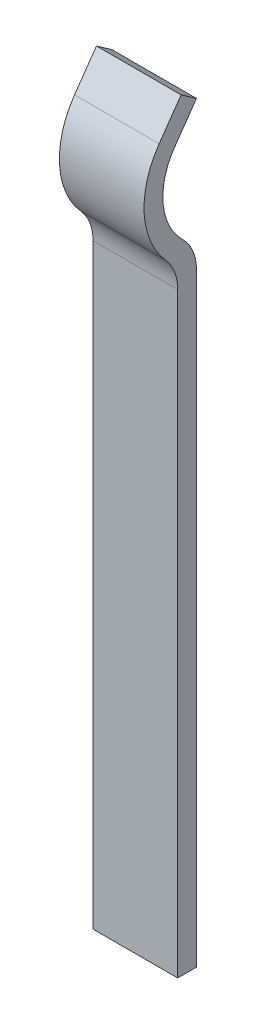
ISO-10303-21;
HEADER;
FILE_DESCRIPTION(('STEP AP214'),'2;1');
FILE_NAME('part.step','',(''),(''),'','','');
FILE_SCHEMA(('AUTOMOTIVE_DESIGN { 1 0 10303 214 1 1 1 1 }'));
ENDSEC;
DATA;
#1=APPLICATION_CONTEXT('core data for automotive mechanical design processes');
#2=APPLICATION_PROTOCOL_DEFINITION('international standard','automotive_design',2000,#1);
#3=PRODUCT_CONTEXT('',#1,'mechanical');
#4=PRODUCT('Part','Part','',(#3));
#5=PRODUCT_RELATED_PRODUCT_CATEGORY('part','',(#4));
#6=PRODUCT_DEFINITION_FORMATION('','',#4);
#7=PRODUCT_DEFINITION_CONTEXT('part definition',#1,'design');
#8=PRODUCT_DEFINITION('design','',#6,#7);
#9=PRODUCT_DEFINITION_SHAPE('','',#8);
#10=(LENGTH_UNIT() NAMED_UNIT(*) SI_UNIT(.MILLI.,.METRE.));
#11=(NAMED_UNIT(*) PLANE_ANGLE_UNIT() SI_UNIT($,.RADIAN.));
#12=(NAMED_UNIT(*) SI_UNIT($,.STERADIAN.) SOLID_ANGLE_UNIT());
#13=UNCERTAINTY_MEASURE_WITH_UNIT(LENGTH_MEASURE(1.E-05),#10,'distance_accuracy_value','');
#14=(GEOMETRIC_REPRESENTATION_CONTEXT(3) GLOBAL_UNCERTAINTY_ASSIGNED_CONTEXT((#13)) GLOBAL_UNIT_ASSIGNED_CONTEXT((#10,
#11,#12)) REPRESENTATION_CONTEXT('',''));
#15=CARTESIAN_POINT('',(0.,0.,0.));
#16=DIRECTION('',(0.,0.,1.));
#17=DIRECTION('',(1.,0.,0.));
#18=AXIS2_PLACEMENT_3D('',#15,#16,#17);
#19=CARTESIAN_POINT('',(0.,5.5,0.));
#20=DIRECTION('',(0.,0.819152044288992,-0.573576436351046));
#21=DIRECTION('',(0.,0.573576436351046,0.819152044288992));
#22=AXIS2_PLACEMENT_3D('',#19,#20,#21);
#23=PLANE('',#22);
#24=DIRECTION('',(0.,0.573576436351046,0.819152044288992));
#25=VECTOR('',#24,1.);
#26=CARTESIAN_POINT('',(1.35,5.5,0.));
#27=LINE('',#26,#25);
#28=CARTESIAN_POINT('',(1.35,5.67207293090531,0.245745613286696));
#29=VERTEX_POINT('',#28);
#30=CARTESIAN_POINT('',(1.35,5.5,0.));
#31=VERTEX_POINT('',#30);
#32=EDGE_CURVE('E155',#29,#31,#27,.F.);
#33=ORIENTED_EDGE('',*,*,#32,.T.);
#34=DIRECTION('',(1.,0.,0.));
#35=VECTOR('',#34,1.);
#36=CARTESIAN_POINT('',(0.,5.5,0.));
#37=LINE('',#36,#35);
#38=CARTESIAN_POINT('',(0.,5.5,0.));
#39=VERTEX_POINT('',#38);
#40=EDGE_CURVE('E149',#39,#31,#37,.T.);
#41=ORIENTED_EDGE('',*,*,#40,.F.);
#42=DIRECTION('',(0.,0.573576436351046,0.819152044288992));
#43=VECTOR('',#42,1.);
#44=CARTESIAN_POINT('',(0.,5.5,0.));
#45=LINE('',#44,#43);
#46=CARTESIAN_POINT('',(0.,5.67207293090531,0.245745613286696));
#47=VERTEX_POINT('',#46);
#48=EDGE_CURVE('E163',#39,#47,#45,.T.);
#49=ORIENTED_EDGE('',*,*,#48,.T.);
#50=DIRECTION('',(1.,0.,0.));
#51=VECTOR('',#50,1.);
#52=CARTESIAN_POINT('',(0.,5.67207293090532,0.245745613286696));
#53=LINE('',#52,#51);
#54=EDGE_CURVE('E102',#29,#47,#53,.F.);
#55=ORIENTED_EDGE('',*,*,#54,.F.);
#56=EDGE_LOOP('',(#33,#41,#49,#55));
#57=FACE_BOUND('',#56,.T.);
#58=ADVANCED_FACE('F16',(#57),#23,.T.);
#59=CARTESIAN_POINT('',(0.,5.,0.350103769104855));
#60=DIRECTION('',(0.,-0.573576436351046,-0.819152044288992));
#61=DIRECTION('',(0.,0.819152044288992,-0.573576436351046));
#62=AXIS2_PLACEMENT_3D('',#59,#60,#61);
#63=PLANE('',#62);
#64=DIRECTION('',(0.,0.819152044288992,-0.573576436351046));
#65=VECTOR('',#64,1.);
#66=CARTESIAN_POINT('',(1.35,5.,0.350103769104855));
#67=LINE('',#66,#65);
#68=CARTESIAN_POINT('',(1.35,5.,0.350103769104855));
#69=VERTEX_POINT('',#68);
#70=EDGE_CURVE('E145',#31,#69,#67,.F.);
#71=ORIENTED_EDGE('',*,*,#70,.T.);
#72=DIRECTION('',(1.,0.,0.));
#73=VECTOR('',#72,1.);
#74=CARTESIAN_POINT('',(0.,5.,0.350103769104856));
#75=LINE('',#74,#73);
#76=CARTESIAN_POINT('',(0.,5.,0.350103769104855));
#77=VERTEX_POINT('',#76);
#78=EDGE_CURVE('E135',#69,#77,#75,.F.);
#79=ORIENTED_EDGE('',*,*,#78,.T.);
#80=DIRECTION('',(0.,0.819152044288992,-0.573576436351046));
#81=VECTOR('',#80,1.);
#82=CARTESIAN_POINT('',(0.,5.,0.350103769104855));
#83=LINE('',#82,#81);
#84=EDGE_CURVE('E152',#77,#39,#83,.T.);
#85=ORIENTED_EDGE('',*,*,#84,.T.);
#86=ORIENTED_EDGE('',*,*,#40,.T.);
#87=EDGE_LOOP('',(#71,#79,#85,#86));
#88=FACE_BOUND('',#87,.T.);
#89=ADVANCED_FACE('F200',(#88),#63,.T.);
#90=CARTESIAN_POINT('',(0.,5.67207293090531,0.245745613286697));
#91=DIRECTION('',(0.,0.573576436351046,0.819152044288992));
#92=DIRECTION('',(0.,-0.819152044288992,0.573576436351046));
#93=AXIS2_PLACEMENT_3D('',#90,#91,#92);
#94=PLANE('',#93);
#95=DIRECTION('',(0.,-0.819152044288992,0.573576436351046));
#96=VECTOR('',#95,1.);
#97=CARTESIAN_POINT('',(1.35,5.67207293090531,0.245745613286697));
#98=LINE('',#97,#96);
#99=CARTESIAN_POINT('',(1.35,5.17207293090531,0.595849382391553));
#100=VERTEX_POINT('',#99);
#101=EDGE_CURVE('E138',#100,#29,#98,.F.);
#102=ORIENTED_EDGE('',*,*,#101,.T.);
#103=ORIENTED_EDGE('',*,*,#54,.T.);
#104=DIRECTION('',(0.,-0.819152044288992,0.573576436351046));
#105=VECTOR('',#104,1.);
#106=CARTESIAN_POINT('',(0.,5.67207293090531,0.245745613286697));
#107=LINE('',#106,#105);
#108=CARTESIAN_POINT('',(0.,5.17207293090531,0.595849382391553));
#109=VERTEX_POINT('',#108);
#110=EDGE_CURVE('E141',#47,#109,#107,.T.);
#111=ORIENTED_EDGE('',*,*,#110,.T.);
#112=DIRECTION('',(1.,0.,0.));
#113=VECTOR('',#112,1.);
#114=CARTESIAN_POINT('',(0.,5.17207293090531,0.595849382391554));
#115=LINE('',#114,#113);
#116=EDGE_CURVE('E109',#100,#109,#115,.F.);
#117=ORIENTED_EDGE('',*,*,#116,.F.);
#118=EDGE_LOOP('',(#102,#103,#111,#117));
#119=FACE_BOUND('',#118,.T.);
#120=ADVANCED_FACE('F194',(#119),#94,.T.);
#121=CARTESIAN_POINT('',(0.,3.01030980567423,1.05));
#122=DIRECTION('',(1.,0.,0.));
#123=DIRECTION('',(0.,0.,-1.));
#124=AXIS2_PLACEMENT_3D('',#121,#122,#123);
#125=CYLINDRICAL_SURFACE('',#124,0.75);
#126=DIRECTION('',(1.,0.,0.));
#127=VECTOR('',#126,1.);
#128=CARTESIAN_POINT('',(0.,3.01030980567423,0.300000000000001));
#129=LINE('',#128,#127);
#130=CARTESIAN_POINT('',(1.35,3.01030980567423,0.300000000000001));
#131=VERTEX_POINT('',#130);
#132=CARTESIAN_POINT('',(0.,3.01030980567423,0.300000000000001));
#133=VERTEX_POINT('',#132);
#134=EDGE_CURVE('E104',#131,#133,#129,.F.);
#135=ORIENTED_EDGE('',*,*,#134,.F.);
#136=CARTESIAN_POINT('',(1.35,3.01030980567423,1.05));
#137=DIRECTION('',(1.,0.,0.));
#138=DIRECTION('',(0.,0.,-1.));
#139=AXIS2_PLACEMENT_3D('',#136,#137,#138);
#140=CIRCLE('',#139,0.75);
#141=CARTESIAN_POINT('',(1.35,3.51287852426735,0.493291204406044));
#142=VERTEX_POINT('',#141);
#143=EDGE_CURVE('E19',#142,#131,#140,.F.);
#144=ORIENTED_EDGE('',*,*,#143,.F.);
#145=DIRECTION('',(1.,0.,0.));
#146=VECTOR('',#145,1.);
#147=CARTESIAN_POINT('',(0.,3.51287852426735,0.493291204406045));
#148=LINE('',#147,#146);
#149=CARTESIAN_POINT('',(0.,3.51287852426735,0.493291204406044));
#150=VERTEX_POINT('',#149);
#151=EDGE_CURVE('E133',#150,#142,#148,.T.);
#152=ORIENTED_EDGE('',*,*,#151,.F.);
#153=CARTESIAN_POINT('',(0.,3.01030980567423,1.05));
#154=DIRECTION('',(1.,0.,0.));
#155=DIRECTION('',(0.,0.,-1.));
#156=AXIS2_PLACEMENT_3D('',#153,#154,#155);
#157=CIRCLE('',#156,0.75);
#158=EDGE_CURVE('E101',#133,#150,#157,.T.);
#159=ORIENTED_EDGE('',*,*,#158,.F.);
#160=EDGE_LOOP('',(#135,#144,#152,#159));
#161=FACE_BOUND('',#160,.T.);
#162=ADVANCED_FACE('F105',(#161),#125,.F.);
#163=CARTESIAN_POINT('',(0.,4.40685683771464,-0.496992455825691));
#164=DIRECTION('',(1.,0.,0.));
#165=DIRECTION('',(0.,0.,-1.));
#166=AXIS2_PLACEMENT_3D('',#163,#164,#165);
#167=CYLINDRICAL_SURFACE('',#166,1.03411354563097);
#168=CARTESIAN_POINT('',(0.,4.40685683771464,-0.496992455825691));
#169=DIRECTION('',(1.,0.,0.));
#170=DIRECTION('',(0.,0.,-1.));
#171=AXIS2_PLACEMENT_3D('',#168,#169,#170);
#172=CIRCLE('',#171,1.03411354563097);
#173=CARTESIAN_POINT('',(0.,3.66728153304479,0.225793262060286));
#174=VERTEX_POINT('',#173);
#175=EDGE_CURVE('E128',#174,#77,#172,.F.);
#176=ORIENTED_EDGE('',*,*,#175,.T.);
#177=ORIENTED_EDGE('',*,*,#78,.F.);
#178=CARTESIAN_POINT('',(1.35,4.40685683771464,-0.496992455825691));
#179=DIRECTION('',(1.,0.,0.));
#180=DIRECTION('',(0.,0.,-1.));
#181=AXIS2_PLACEMENT_3D('',#178,#179,#180);
#182=CIRCLE('',#181,1.03411354563097);
#183=CARTESIAN_POINT('',(1.35,3.66728153304479,0.225793262060286));
#184=VERTEX_POINT('',#183);
#185=EDGE_CURVE('E117',#184,#69,#182,.F.);
#186=ORIENTED_EDGE('',*,*,#185,.F.);
#187=DIRECTION('',(1.,0.,0.));
#188=VECTOR('',#187,1.);
#189=CARTESIAN_POINT('',(0.,3.66728153304479,0.225793262060286));
#190=LINE('',#189,#188);
#191=EDGE_CURVE('E108',#174,#184,#190,.T.);
#192=ORIENTED_EDGE('',*,*,#191,.F.);
#193=EDGE_LOOP('',(#176,#177,#186,#192));
#194=FACE_BOUND('',#193,.T.);
#195=ADVANCED_FACE('F205',(#194),#167,.F.);
#196=CARTESIAN_POINT('',(0.,4.40685683771464,-0.496992455825691));
#197=DIRECTION('',(1.,0.,0.));
#198=DIRECTION('',(0.,0.,-1.));
#199=AXIS2_PLACEMENT_3D('',#196,#197,#198);
#200=CYLINDRICAL_SURFACE('',#199,1.33411354563097);
#201=ORIENTED_EDGE('',*,*,#116,.T.);
#202=CARTESIAN_POINT('',(0.,4.40685683771464,-0.496992455825691));
#203=DIRECTION('',(1.,0.,0.));
#204=DIRECTION('',(0.,0.,-1.));
#205=AXIS2_PLACEMENT_3D('',#202,#203,#204);
#206=CIRCLE('',#205,1.33411354563097);
#207=EDGE_CURVE('E178',#109,#150,#206,.T.);
#208=ORIENTED_EDGE('',*,*,#207,.T.);
#209=ORIENTED_EDGE('',*,*,#151,.T.);
#210=CARTESIAN_POINT('',(1.35,4.40685683771464,-0.496992455825691));
#211=DIRECTION('',(1.,0.,0.));
#212=DIRECTION('',(0.,0.,-1.));
#213=AXIS2_PLACEMENT_3D('',#210,#211,#212);
#214=CIRCLE('',#213,1.33411354563097);
#215=EDGE_CURVE('E100',#100,#142,#214,.T.);
#216=ORIENTED_EDGE('',*,*,#215,.F.);
#217=EDGE_LOOP('',(#201,#208,#209,#216));
#218=FACE_BOUND('',#217,.T.);
#219=ADVANCED_FACE('F191',(#218),#200,.T.);
#220=CARTESIAN_POINT('',(0.,3.33696806873304,0.300000000000001));
#221=DIRECTION('',(0.,0.,1.));
#222=DIRECTION('',(1.,0.,0.));
#223=AXIS2_PLACEMENT_3D('',#220,#221,#222);
#224=PLANE('',#223);
#225=DIRECTION('',(1.,0.,0.));
#226=VECTOR('',#225,1.);
#227=CARTESIAN_POINT('',(0.,-6.5,0.299999999999999));
#228=LINE('',#227,#226);
#229=CARTESIAN_POINT('',(1.35,-6.5,0.3));
#230=VERTEX_POINT('',#229);
#231=CARTESIAN_POINT('',(0.,-6.5,0.3));
#232=VERTEX_POINT('',#231);
#233=EDGE_CURVE('E112',#230,#232,#228,.F.);
#234=ORIENTED_EDGE('',*,*,#233,.F.);
#235=DIRECTION('',(0.,1.,0.));
#236=VECTOR('',#235,1.);
#237=CARTESIAN_POINT('',(1.35,-0.503811349581282,0.300000000000001));
#238=LINE('',#237,#236);
#239=EDGE_CURVE('E97',#131,#230,#238,.F.);
#240=ORIENTED_EDGE('',*,*,#239,.F.);
#241=ORIENTED_EDGE('',*,*,#134,.T.);
#242=DIRECTION('',(0.,1.,0.));
#243=VECTOR('',#242,1.);
#244=CARTESIAN_POINT('',(0.,-0.503811349581282,0.300000000000001));
#245=LINE('',#244,#243);
#246=EDGE_CURVE('E181',#133,#232,#245,.F.);
#247=ORIENTED_EDGE('',*,*,#246,.T.);
#248=EDGE_LOOP('',(#234,#240,#241,#247));
#249=FACE_BOUND('',#248,.T.);
#250=ADVANCED_FACE('F111',(#249),#224,.T.);
#251=CARTESIAN_POINT('',(0.,3.13089799871641,0.75));
#252=DIRECTION('',(1.,0.,0.));
#253=DIRECTION('',(0.,0.,-1.));
#254=AXIS2_PLACEMENT_3D('',#251,#252,#253);
#255=CYLINDRICAL_SURFACE('',#254,0.75);
#256=CARTESIAN_POINT('',(0.,3.13089799871641,0.75));
#257=DIRECTION('',(1.,0.,0.));
#258=DIRECTION('',(0.,0.,-1.));
#259=AXIS2_PLACEMENT_3D('',#256,#257,#258);
#260=CIRCLE('',#259,0.75);
#261=CARTESIAN_POINT('',(0.,3.13089799871641,0.));
#262=VERTEX_POINT('',#261);
#263=EDGE_CURVE('E174',#262,#174,#260,.T.);
#264=ORIENTED_EDGE('',*,*,#263,.T.);
#265=ORIENTED_EDGE('',*,*,#191,.T.);
#266=CARTESIAN_POINT('',(1.35,3.13089799871641,0.75));
#267=DIRECTION('',(1.,0.,0.));
#268=DIRECTION('',(0.,0.,-1.));
#269=AXIS2_PLACEMENT_3D('',#266,#267,#268);
#270=CIRCLE('',#269,0.75);
#271=CARTESIAN_POINT('',(1.35,3.13089799871641,0.));
#272=VERTEX_POINT('',#271);
#273=EDGE_CURVE('E126',#272,#184,#270,.T.);
#274=ORIENTED_EDGE('',*,*,#273,.F.);
#275=DIRECTION('',(-1.,0.,0.));
#276=VECTOR('',#275,1.);
#277=CARTESIAN_POINT('',(0.,3.13089799871641,0.));
#278=LINE('',#277,#276);
#279=EDGE_CURVE('E177',#262,#272,#278,.F.);
#280=ORIENTED_EDGE('',*,*,#279,.F.);
#281=EDGE_LOOP('',(#264,#265,#274,#280));
#282=FACE_BOUND('',#281,.T.);
#283=ADVANCED_FACE('F208',(#282),#255,.T.);
#284=CARTESIAN_POINT('',(1.35,-0.503811349581282,0.203319222379208));
#285=DIRECTION('',(1.,0.,0.));
#286=DIRECTION('',(0.,0.,-1.));
#287=AXIS2_PLACEMENT_3D('',#284,#285,#286);
#288=PLANE('',#287);
#289=DIRECTION('',(0.,0.,-1.));
#290=VECTOR('',#289,1.);
#291=CARTESIAN_POINT('',(1.35,-6.5,0.299999999999999));
#292=LINE('',#291,#290);
#293=CARTESIAN_POINT('',(1.35,-6.5,0.));
#294=VERTEX_POINT('',#293);
#295=EDGE_CURVE('E114',#294,#230,#292,.F.);
#296=ORIENTED_EDGE('',*,*,#295,.F.);
#297=DIRECTION('',(0.,1.,0.));
#298=VECTOR('',#297,1.);
#299=CARTESIAN_POINT('',(1.35,-6.5,0.));
#300=LINE('',#299,#298);
#301=EDGE_CURVE('E213',#272,#294,#300,.F.);
#302=ORIENTED_EDGE('',*,*,#301,.F.);
#303=ORIENTED_EDGE('',*,*,#273,.T.);
#304=ORIENTED_EDGE('',*,*,#185,.T.);
#305=ORIENTED_EDGE('',*,*,#70,.F.);
#306=ORIENTED_EDGE('',*,*,#32,.F.);
#307=ORIENTED_EDGE('',*,*,#101,.F.);
#308=ORIENTED_EDGE('',*,*,#215,.T.);
#309=ORIENTED_EDGE('',*,*,#143,.T.);
#310=ORIENTED_EDGE('',*,*,#239,.T.);
#311=EDGE_LOOP('',(#296,#302,#303,#304,#305,#306,#307,#308,#309,#310));
#312=FACE_BOUND('',#311,.T.);
#313=ADVANCED_FACE('F95',(#312),#288,.T.);
#314=CARTESIAN_POINT('',(0.,-6.5,0.299999999999999));
#315=DIRECTION('',(0.,-1.,0.));
#316=DIRECTION('',(0.,0.,-1.));
#317=AXIS2_PLACEMENT_3D('',#314,#315,#316);
#318=PLANE('',#317);
#319=ORIENTED_EDGE('',*,*,#295,.T.);
#320=ORIENTED_EDGE('',*,*,#233,.T.);
#321=DIRECTION('',(0.,0.,-1.));
#322=VECTOR('',#321,1.);
#323=CARTESIAN_POINT('',(0.,-6.5,0.203319222379208));
#324=LINE('',#323,#322);
#325=CARTESIAN_POINT('',(0.,-6.5,0.));
#326=VERTEX_POINT('',#325);
#327=EDGE_CURVE('E34',#232,#326,#324,.T.);
#328=ORIENTED_EDGE('',*,*,#327,.T.);
#329=DIRECTION('',(-1.,0.,0.));
#330=VECTOR('',#329,1.);
#331=CARTESIAN_POINT('',(0.,-6.5,0.));
#332=LINE('',#331,#330);
#333=EDGE_CURVE('E25',#294,#326,#332,.T.);
#334=ORIENTED_EDGE('',*,*,#333,.F.);
#335=EDGE_LOOP('',(#319,#320,#328,#334));
#336=FACE_BOUND('',#335,.T.);
#337=ADVANCED_FACE('F230',(#336),#318,.T.);
#338=CARTESIAN_POINT('',(0.,-0.503811349581282,0.203319222379208));
#339=DIRECTION('',(1.,0.,0.));
#340=DIRECTION('',(0.,0.,-1.));
#341=AXIS2_PLACEMENT_3D('',#338,#339,#340);
#342=PLANE('',#341);
#343=DIRECTION('',(0.,1.,0.));
#344=VECTOR('',#343,1.);
#345=CARTESIAN_POINT('',(0.,-6.5,0.));
#346=LINE('',#345,#344);
#347=EDGE_CURVE('E11',#326,#262,#346,.T.);
#348=ORIENTED_EDGE('',*,*,#347,.F.);
#349=ORIENTED_EDGE('',*,*,#327,.F.);
#350=ORIENTED_EDGE('',*,*,#246,.F.);
#351=ORIENTED_EDGE('',*,*,#158,.T.);
#352=ORIENTED_EDGE('',*,*,#207,.F.);
#353=ORIENTED_EDGE('',*,*,#110,.F.);
#354=ORIENTED_EDGE('',*,*,#48,.F.);
#355=ORIENTED_EDGE('',*,*,#84,.F.);
#356=ORIENTED_EDGE('',*,*,#175,.F.);
#357=ORIENTED_EDGE('',*,*,#263,.F.);
#358=EDGE_LOOP('',(#348,#349,#350,#351,#352,#353,#354,#355,#356,#357));
#359=FACE_BOUND('',#358,.T.);
#360=ADVANCED_FACE('F189',(#359),#342,.F.);
#361=CARTESIAN_POINT('',(0.,-6.5,0.));
#362=DIRECTION('',(0.,0.,-1.));
#363=DIRECTION('',(-1.,0.,0.));
#364=AXIS2_PLACEMENT_3D('',#361,#362,#363);
#365=PLANE('',#364);
#366=ORIENTED_EDGE('',*,*,#333,.T.);
#367=ORIENTED_EDGE('',*,*,#347,.T.);
#368=ORIENTED_EDGE('',*,*,#279,.T.);
#369=ORIENTED_EDGE('',*,*,#301,.T.);
#370=EDGE_LOOP('',(#366,#367,#368,#369));
#371=FACE_BOUND('',#370,.T.);
#372=ADVANCED_FACE('F229',(#371),#365,.T.);
#373=CLOSED_SHELL('',(#58,#89,#120,#162,#195,#219,#250,#283,#313,#337,#360,#372));
#374=MANIFOLD_SOLID_BREP('B1',#373);
#375=ADVANCED_BREP_SHAPE_REPRESENTATION('',(#18,#374),#14);
#376=SHAPE_DEFINITION_REPRESENTATION(#9,#375);
ENDSEC;
END-ISO-10303-21;
